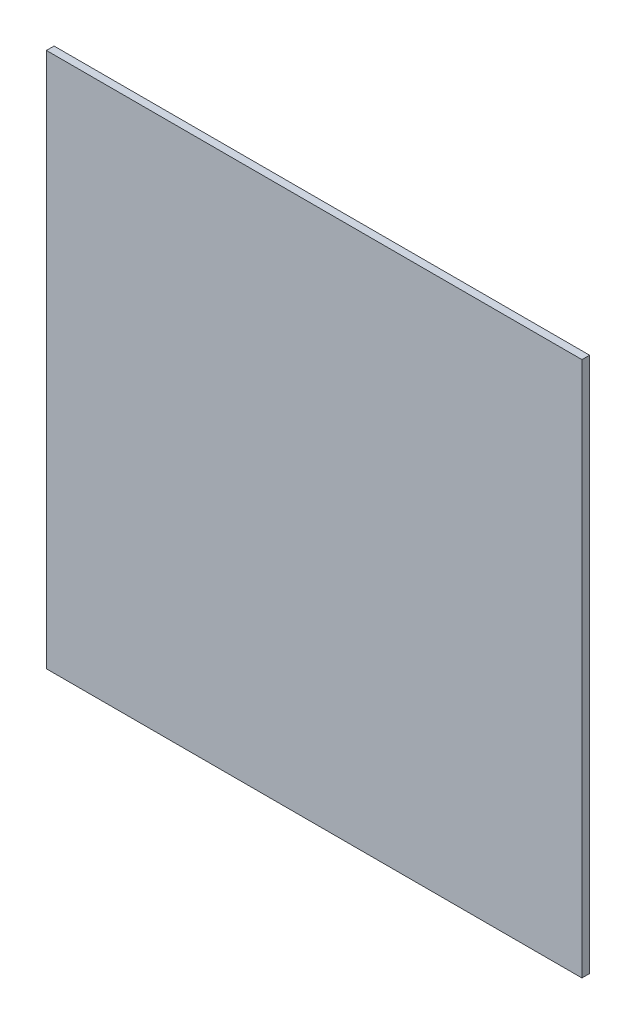
ISO-10303-21;
HEADER;
FILE_DESCRIPTION(('STEP AP214'),'2;1');
FILE_NAME('part.step','',(''),(''),'','','');
FILE_SCHEMA(('AUTOMOTIVE_DESIGN { 1 0 10303 214 1 1 1 1 }'));
ENDSEC;
DATA;
#1=APPLICATION_CONTEXT('core data for automotive mechanical design processes');
#2=APPLICATION_PROTOCOL_DEFINITION('international standard','automotive_design',2000,#1);
#3=PRODUCT_CONTEXT('',#1,'mechanical');
#4=PRODUCT('Part','Part','',(#3));
#5=PRODUCT_RELATED_PRODUCT_CATEGORY('part','',(#4));
#6=PRODUCT_DEFINITION_FORMATION('','',#4);
#7=PRODUCT_DEFINITION_CONTEXT('part definition',#1,'design');
#8=PRODUCT_DEFINITION('design','',#6,#7);
#9=PRODUCT_DEFINITION_SHAPE('','',#8);
#10=(LENGTH_UNIT() NAMED_UNIT(*) SI_UNIT(.MILLI.,.METRE.));
#11=(NAMED_UNIT(*) PLANE_ANGLE_UNIT() SI_UNIT($,.RADIAN.));
#12=(NAMED_UNIT(*) SI_UNIT($,.STERADIAN.) SOLID_ANGLE_UNIT());
#13=UNCERTAINTY_MEASURE_WITH_UNIT(LENGTH_MEASURE(1.E-05),#10,'distance_accuracy_value','');
#14=(GEOMETRIC_REPRESENTATION_CONTEXT(3) GLOBAL_UNCERTAINTY_ASSIGNED_CONTEXT((#13)) GLOBAL_UNIT_ASSIGNED_CONTEXT((#10,
#11,#12)) REPRESENTATION_CONTEXT('',''));
#15=CARTESIAN_POINT('',(0.,0.,0.));
#16=DIRECTION('',(0.,0.,1.));
#17=DIRECTION('',(1.,0.,0.));
#18=AXIS2_PLACEMENT_3D('',#15,#16,#17);
#19=CARTESIAN_POINT('',(-62.4441307758997,24.4849785407725,1.));
#20=DIRECTION('',(1.,0.,0.));
#21=DIRECTION('',(0.,1.,0.));
#22=AXIS2_PLACEMENT_3D('',#19,#20,#21);
#23=PLANE('',#22);
#24=DIRECTION('',(0.,-1.,0.));
#25=VECTOR('',#24,1.);
#26=CARTESIAN_POINT('',(-62.4441307758997,24.4849785407725,0.));
#27=LINE('',#26,#25);
#28=CARTESIAN_POINT('',(-62.4441307758997,24.4849785407725,0.));
#29=VERTEX_POINT('',#28);
#30=CARTESIAN_POINT('',(-62.4441307758997,-45.5150214592275,0.));
#31=VERTEX_POINT('',#30);
#32=EDGE_CURVE('E96',#29,#31,#27,.T.);
#33=ORIENTED_EDGE('',*,*,#32,.T.);
#34=DIRECTION('',(0.,0.,-1.));
#35=VECTOR('',#34,1.);
#36=CARTESIAN_POINT('',(-62.4441307758997,-45.5150214592275,1.));
#37=LINE('',#36,#35);
#38=CARTESIAN_POINT('',(-62.4441307758997,-45.5150214592275,1.));
#39=VERTEX_POINT('',#38);
#40=EDGE_CURVE('E11',#39,#31,#37,.T.);
#41=ORIENTED_EDGE('',*,*,#40,.F.);
#42=DIRECTION('',(0.,-1.,0.));
#43=VECTOR('',#42,1.);
#44=CARTESIAN_POINT('',(-62.4441307758997,24.4849785407725,1.));
#45=LINE('',#44,#43);
#46=CARTESIAN_POINT('',(-62.4441307758997,24.4849785407725,1.));
#47=VERTEX_POINT('',#46);
#48=EDGE_CURVE('E84',#47,#39,#45,.T.);
#49=ORIENTED_EDGE('',*,*,#48,.F.);
#50=DIRECTION('',(0.,0.,-1.));
#51=VECTOR('',#50,1.);
#52=CARTESIAN_POINT('',(-62.4441307758997,24.4849785407725,1.));
#53=LINE('',#52,#51);
#54=EDGE_CURVE('E92',#47,#29,#53,.T.);
#55=ORIENTED_EDGE('',*,*,#54,.T.);
#56=EDGE_LOOP('',(#33,#41,#49,#55));
#57=FACE_BOUND('',#56,.T.);
#58=ADVANCED_FACE('F33',(#57),#23,.F.);
#59=CARTESIAN_POINT('',(-62.4441307758997,-45.5150214592275,1.));
#60=DIRECTION('',(0.,1.,0.));
#61=DIRECTION('',(0.,0.,1.));
#62=AXIS2_PLACEMENT_3D('',#59,#60,#61);
#63=PLANE('',#62);
#64=DIRECTION('',(1.,0.,0.));
#65=VECTOR('',#64,1.);
#66=CARTESIAN_POINT('',(-62.4441307758997,-45.5150214592275,0.));
#67=LINE('',#66,#65);
#68=CARTESIAN_POINT('',(7.55586922410028,-45.5150214592275,0.));
#69=VERTEX_POINT('',#68);
#70=EDGE_CURVE('E88',#31,#69,#67,.T.);
#71=ORIENTED_EDGE('',*,*,#70,.T.);
#72=DIRECTION('',(0.,0.,-1.));
#73=VECTOR('',#72,1.);
#74=CARTESIAN_POINT('',(7.55586922410028,-45.5150214592275,1.));
#75=LINE('',#74,#73);
#76=CARTESIAN_POINT('',(7.55586922410028,-45.5150214592275,1.));
#77=VERTEX_POINT('',#76);
#78=EDGE_CURVE('E41',#77,#69,#75,.T.);
#79=ORIENTED_EDGE('',*,*,#78,.F.);
#80=DIRECTION('',(1.,0.,0.));
#81=VECTOR('',#80,1.);
#82=CARTESIAN_POINT('',(-62.4441307758997,-45.5150214592275,1.));
#83=LINE('',#82,#81);
#84=EDGE_CURVE('E79',#39,#77,#83,.T.);
#85=ORIENTED_EDGE('',*,*,#84,.F.);
#86=ORIENTED_EDGE('',*,*,#40,.T.);
#87=EDGE_LOOP('',(#71,#79,#85,#86));
#88=FACE_BOUND('',#87,.T.);
#89=ADVANCED_FACE('F87',(#88),#63,.F.);
#90=CARTESIAN_POINT('',(7.55586922410027,24.4849785407725,1.));
#91=DIRECTION('',(-1.,0.,0.));
#92=DIRECTION('',(0.,-1.,0.));
#93=AXIS2_PLACEMENT_3D('',#90,#91,#92);
#94=PLANE('',#93);
#95=DIRECTION('',(0.,1.,0.));
#96=VECTOR('',#95,1.);
#97=CARTESIAN_POINT('',(7.55586922410027,24.4849785407725,0.));
#98=LINE('',#97,#96);
#99=CARTESIAN_POINT('',(7.55586922410027,24.4849785407725,0.));
#100=VERTEX_POINT('',#99);
#101=EDGE_CURVE('E66',#69,#100,#98,.T.);
#102=ORIENTED_EDGE('',*,*,#101,.T.);
#103=DIRECTION('',(0.,0.,-1.));
#104=VECTOR('',#103,1.);
#105=CARTESIAN_POINT('',(7.55586922410027,24.4849785407725,1.));
#106=LINE('',#105,#104);
#107=CARTESIAN_POINT('',(7.55586922410027,24.4849785407725,1.));
#108=VERTEX_POINT('',#107);
#109=EDGE_CURVE('E89',#108,#100,#106,.T.);
#110=ORIENTED_EDGE('',*,*,#109,.F.);
#111=DIRECTION('',(0.,1.,0.));
#112=VECTOR('',#111,1.);
#113=CARTESIAN_POINT('',(7.55586922410027,24.4849785407725,1.));
#114=LINE('',#113,#112);
#115=EDGE_CURVE('E82',#77,#108,#114,.T.);
#116=ORIENTED_EDGE('',*,*,#115,.F.);
#117=ORIENTED_EDGE('',*,*,#78,.T.);
#118=EDGE_LOOP('',(#102,#110,#116,#117));
#119=FACE_BOUND('',#118,.T.);
#120=ADVANCED_FACE('F90',(#119),#94,.F.);
#121=CARTESIAN_POINT('',(-62.4441307758997,24.4849785407725,1.));
#122=DIRECTION('',(0.,-1.,0.));
#123=DIRECTION('',(0.,0.,-1.));
#124=AXIS2_PLACEMENT_3D('',#121,#122,#123);
#125=PLANE('',#124);
#126=DIRECTION('',(-1.,0.,0.));
#127=VECTOR('',#126,1.);
#128=CARTESIAN_POINT('',(-62.4441307758997,24.4849785407725,0.));
#129=LINE('',#128,#127);
#130=EDGE_CURVE('E72',#100,#29,#129,.T.);
#131=ORIENTED_EDGE('',*,*,#130,.T.);
#132=ORIENTED_EDGE('',*,*,#54,.F.);
#133=DIRECTION('',(-1.,0.,0.));
#134=VECTOR('',#133,1.);
#135=CARTESIAN_POINT('',(-62.4441307758997,24.4849785407725,1.));
#136=LINE('',#135,#134);
#137=EDGE_CURVE('E49',#108,#47,#136,.T.);
#138=ORIENTED_EDGE('',*,*,#137,.F.);
#139=ORIENTED_EDGE('',*,*,#109,.T.);
#140=EDGE_LOOP('',(#131,#132,#138,#139));
#141=FACE_BOUND('',#140,.T.);
#142=ADVANCED_FACE('F103',(#141),#125,.F.);
#143=CARTESIAN_POINT('',(0.,0.,1.));
#144=DIRECTION('',(0.,0.,1.));
#145=DIRECTION('',(1.,0.,0.));
#146=AXIS2_PLACEMENT_3D('',#143,#144,#145);
#147=PLANE('',#146);
#148=ORIENTED_EDGE('',*,*,#48,.T.);
#149=ORIENTED_EDGE('',*,*,#84,.T.);
#150=ORIENTED_EDGE('',*,*,#115,.T.);
#151=ORIENTED_EDGE('',*,*,#137,.T.);
#152=EDGE_LOOP('',(#148,#149,#150,#151));
#153=FACE_BOUND('',#152,.T.);
#154=ADVANCED_FACE('F80',(#153),#147,.T.);
#155=CARTESIAN_POINT('',(0.,0.,0.));
#156=DIRECTION('',(0.,0.,1.));
#157=DIRECTION('',(1.,0.,0.));
#158=AXIS2_PLACEMENT_3D('',#155,#156,#157);
#159=PLANE('',#158);
#160=ORIENTED_EDGE('',*,*,#32,.F.);
#161=ORIENTED_EDGE('',*,*,#130,.F.);
#162=ORIENTED_EDGE('',*,*,#101,.F.);
#163=ORIENTED_EDGE('',*,*,#70,.F.);
#164=EDGE_LOOP('',(#160,#161,#162,#163));
#165=FACE_BOUND('',#164,.T.);
#166=ADVANCED_FACE('F106',(#165),#159,.F.);
#167=CLOSED_SHELL('',(#58,#89,#120,#142,#154,#166));
#168=MANIFOLD_SOLID_BREP('B2',#167);
#169=ADVANCED_BREP_SHAPE_REPRESENTATION('',(#18,#168),#14);
#170=SHAPE_DEFINITION_REPRESENTATION(#9,#169);
ENDSEC;
END-ISO-10303-21;
